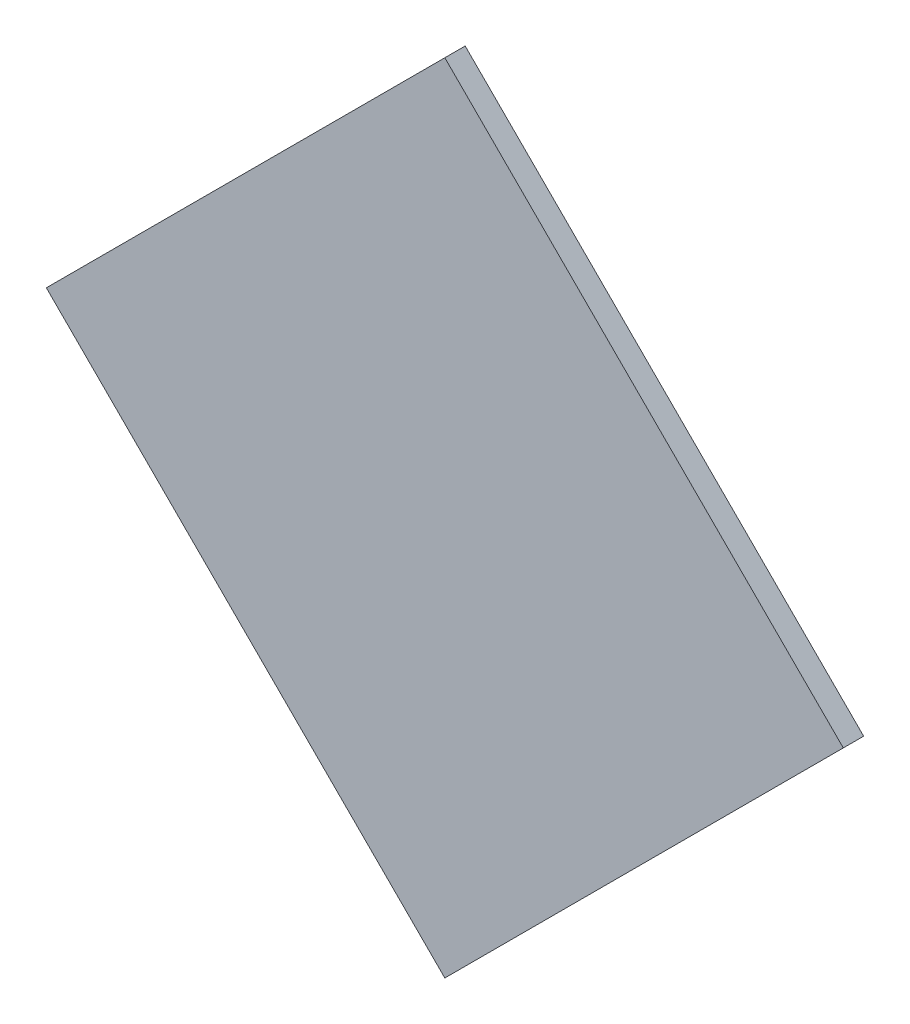
ISO-10303-21;
HEADER;
FILE_DESCRIPTION(('STEP AP214'),'2;1');
FILE_NAME('part.step','',(''),(''),'','','');
FILE_SCHEMA(('AUTOMOTIVE_DESIGN { 1 0 10303 214 1 1 1 1 }'));
ENDSEC;
DATA;
#1=APPLICATION_CONTEXT('core data for automotive mechanical design processes');
#2=APPLICATION_PROTOCOL_DEFINITION('international standard','automotive_design',2000,#1);
#3=PRODUCT_CONTEXT('',#1,'mechanical');
#4=PRODUCT('Part','Part','',(#3));
#5=PRODUCT_RELATED_PRODUCT_CATEGORY('part','',(#4));
#6=PRODUCT_DEFINITION_FORMATION('','',#4);
#7=PRODUCT_DEFINITION_CONTEXT('part definition',#1,'design');
#8=PRODUCT_DEFINITION('design','',#6,#7);
#9=PRODUCT_DEFINITION_SHAPE('','',#8);
#10=(LENGTH_UNIT() NAMED_UNIT(*) SI_UNIT(.MILLI.,.METRE.));
#11=(NAMED_UNIT(*) PLANE_ANGLE_UNIT() SI_UNIT($,.RADIAN.));
#12=(NAMED_UNIT(*) SI_UNIT($,.STERADIAN.) SOLID_ANGLE_UNIT());
#13=UNCERTAINTY_MEASURE_WITH_UNIT(LENGTH_MEASURE(1.E-05),#10,'distance_accuracy_value','');
#14=(GEOMETRIC_REPRESENTATION_CONTEXT(3) GLOBAL_UNCERTAINTY_ASSIGNED_CONTEXT((#13)) GLOBAL_UNIT_ASSIGNED_CONTEXT((#10,
#11,#12)) REPRESENTATION_CONTEXT('',''));
#15=CARTESIAN_POINT('',(0.,0.,0.));
#16=DIRECTION('',(0.,0.,1.));
#17=DIRECTION('',(1.,0.,0.));
#18=AXIS2_PLACEMENT_3D('',#15,#16,#17);
#19=CARTESIAN_POINT('',(6.253942,4.089398,0.76487));
#20=DIRECTION('',(0.,0.,-1.));
#21=DIRECTION('',(0.,1.,0.));
#22=AXIS2_PLACEMENT_3D('',#19,#20,#21);
#23=PLANE('',#22);
#24=DIRECTION('',(0.707106781186548,0.707106781186548,0.));
#25=VECTOR('',#24,1.);
#26=CARTESIAN_POINT('',(5.582190667,4.089398,0.76487));
#27=LINE('',#26,#25);
#28=CARTESIAN_POINT('',(5.582190667,4.089398,0.76487));
#29=VERTEX_POINT('',#28);
#30=CARTESIAN_POINT('',(6.253942,4.761149333,0.76487));
#31=VERTEX_POINT('',#30);
#32=EDGE_CURVE('E55',#29,#31,#27,.T.);
#33=ORIENTED_EDGE('',*,*,#32,.T.);
#34=DIRECTION('',(0.707106781186548,-0.707106781186548,0.));
#35=VECTOR('',#34,1.);
#36=CARTESIAN_POINT('',(6.253942,4.761149333,0.76487));
#37=LINE('',#36,#35);
#38=CARTESIAN_POINT('',(6.925693333,4.089398,0.76487));
#39=VERTEX_POINT('',#38);
#40=EDGE_CURVE('E57',#31,#39,#37,.T.);
#41=ORIENTED_EDGE('',*,*,#40,.T.);
#42=DIRECTION('',(-0.707106781186548,-0.707106781186548,0.));
#43=VECTOR('',#42,1.);
#44=CARTESIAN_POINT('',(6.925693333,4.089398,0.76487));
#45=LINE('',#44,#43);
#46=CARTESIAN_POINT('',(6.253942,3.417646667,0.76487));
#47=VERTEX_POINT('',#46);
#48=EDGE_CURVE('E20',#39,#47,#45,.T.);
#49=ORIENTED_EDGE('',*,*,#48,.T.);
#50=DIRECTION('',(-0.707106781186548,0.707106781186548,0.));
#51=VECTOR('',#50,1.);
#52=CARTESIAN_POINT('',(6.253942,3.417646667,0.76487));
#53=LINE('',#52,#51);
#54=EDGE_CURVE('E80',#47,#29,#53,.T.);
#55=ORIENTED_EDGE('',*,*,#54,.T.);
#56=EDGE_LOOP('',(#33,#41,#49,#55));
#57=FACE_BOUND('',#56,.T.);
#58=ADVANCED_FACE('F17',(#57),#23,.T.);
#59=CARTESIAN_POINT('',(6.925693333,4.089398,0.76487));
#60=DIRECTION('',(-0.707106781186548,0.707106781186548,0.));
#61=DIRECTION('',(-0.707106781186548,-0.707106781186548,0.));
#62=AXIS2_PLACEMENT_3D('',#59,#60,#61);
#63=PLANE('',#62);
#64=DIRECTION('',(0.,0.,1.));
#65=VECTOR('',#64,1.);
#66=CARTESIAN_POINT('',(6.253942,3.417646667,0.76487));
#67=LINE('',#66,#65);
#68=CARTESIAN_POINT('',(6.253942,3.417646667,0.79916));
#69=VERTEX_POINT('',#68);
#70=EDGE_CURVE('E68',#69,#47,#67,.F.);
#71=ORIENTED_EDGE('',*,*,#70,.T.);
#72=ORIENTED_EDGE('',*,*,#48,.F.);
#73=DIRECTION('',(0.,0.,1.));
#74=VECTOR('',#73,1.);
#75=CARTESIAN_POINT('',(6.925693333,4.089398,0.76487));
#76=LINE('',#75,#74);
#77=CARTESIAN_POINT('',(6.925693333,4.089398,0.79916));
#78=VERTEX_POINT('',#77);
#79=EDGE_CURVE('E63',#39,#78,#76,.T.);
#80=ORIENTED_EDGE('',*,*,#79,.T.);
#81=DIRECTION('',(0.707106781186548,0.707106781186548,0.));
#82=VECTOR('',#81,1.);
#83=CARTESIAN_POINT('',(6.253942,3.417646667,0.79916));
#84=LINE('',#83,#82);
#85=EDGE_CURVE('E83',#69,#78,#84,.T.);
#86=ORIENTED_EDGE('',*,*,#85,.F.);
#87=EDGE_LOOP('',(#71,#72,#80,#86));
#88=FACE_BOUND('',#87,.T.);
#89=ADVANCED_FACE('F65',(#88),#63,.F.);
#90=CARTESIAN_POINT('',(6.253942,4.761149333,0.76487));
#91=DIRECTION('',(-0.707106781186548,-0.707106781186548,0.));
#92=DIRECTION('',(0.707106781186548,-0.707106781186548,0.));
#93=AXIS2_PLACEMENT_3D('',#90,#91,#92);
#94=PLANE('',#93);
#95=ORIENTED_EDGE('',*,*,#79,.F.);
#96=ORIENTED_EDGE('',*,*,#40,.F.);
#97=DIRECTION('',(0.,0.,1.));
#98=VECTOR('',#97,1.);
#99=CARTESIAN_POINT('',(6.253942,4.761149333,0.76487));
#100=LINE('',#99,#98);
#101=CARTESIAN_POINT('',(6.253942,4.761149333,0.79916));
#102=VERTEX_POINT('',#101);
#103=EDGE_CURVE('E75',#31,#102,#100,.T.);
#104=ORIENTED_EDGE('',*,*,#103,.T.);
#105=DIRECTION('',(-0.707106781186548,0.707106781186548,0.));
#106=VECTOR('',#105,1.);
#107=CARTESIAN_POINT('',(6.925693333,4.089398,0.79916));
#108=LINE('',#107,#106);
#109=EDGE_CURVE('E72',#78,#102,#108,.T.);
#110=ORIENTED_EDGE('',*,*,#109,.F.);
#111=EDGE_LOOP('',(#95,#96,#104,#110));
#112=FACE_BOUND('',#111,.T.);
#113=ADVANCED_FACE('F70',(#112),#94,.F.);
#114=CARTESIAN_POINT('',(5.582190667,4.089398,0.76487));
#115=DIRECTION('',(0.707106781186548,-0.707106781186548,0.));
#116=DIRECTION('',(0.707106781186548,0.707106781186548,0.));
#117=AXIS2_PLACEMENT_3D('',#114,#115,#116);
#118=PLANE('',#117);
#119=ORIENTED_EDGE('',*,*,#103,.F.);
#120=ORIENTED_EDGE('',*,*,#32,.F.);
#121=DIRECTION('',(0.,0.,1.));
#122=VECTOR('',#121,1.);
#123=CARTESIAN_POINT('',(5.582190667,4.089398,0.76487));
#124=LINE('',#123,#122);
#125=CARTESIAN_POINT('',(5.582190667,4.089398,0.79916));
#126=VERTEX_POINT('',#125);
#127=EDGE_CURVE('E35',#29,#126,#124,.T.);
#128=ORIENTED_EDGE('',*,*,#127,.T.);
#129=DIRECTION('',(-0.707106781186548,-0.707106781186548,0.));
#130=VECTOR('',#129,1.);
#131=CARTESIAN_POINT('',(6.253942,4.761149333,0.79916));
#132=LINE('',#131,#130);
#133=EDGE_CURVE('E26',#102,#126,#132,.T.);
#134=ORIENTED_EDGE('',*,*,#133,.F.);
#135=EDGE_LOOP('',(#119,#120,#128,#134));
#136=FACE_BOUND('',#135,.T.);
#137=ADVANCED_FACE('F89',(#136),#118,.F.);
#138=CARTESIAN_POINT('',(6.253942,3.417646667,0.76487));
#139=DIRECTION('',(0.707106781186548,0.707106781186548,0.));
#140=DIRECTION('',(-0.707106781186548,0.707106781186548,0.));
#141=AXIS2_PLACEMENT_3D('',#138,#139,#140);
#142=PLANE('',#141);
#143=ORIENTED_EDGE('',*,*,#127,.F.);
#144=ORIENTED_EDGE('',*,*,#54,.F.);
#145=ORIENTED_EDGE('',*,*,#70,.F.);
#146=DIRECTION('',(0.707106781186548,-0.707106781186548,0.));
#147=VECTOR('',#146,1.);
#148=CARTESIAN_POINT('',(5.582190667,4.089398,0.79916));
#149=LINE('',#148,#147);
#150=EDGE_CURVE('E11',#126,#69,#149,.T.);
#151=ORIENTED_EDGE('',*,*,#150,.F.);
#152=EDGE_LOOP('',(#143,#144,#145,#151));
#153=FACE_BOUND('',#152,.T.);
#154=ADVANCED_FACE('F91',(#153),#142,.F.);
#155=CARTESIAN_POINT('',(6.253942,4.089398,0.79916));
#156=DIRECTION('',(0.,0.,1.));
#157=DIRECTION('',(0.,-1.,0.));
#158=AXIS2_PLACEMENT_3D('',#155,#156,#157);
#159=PLANE('',#158);
#160=ORIENTED_EDGE('',*,*,#133,.T.);
#161=ORIENTED_EDGE('',*,*,#150,.T.);
#162=ORIENTED_EDGE('',*,*,#85,.T.);
#163=ORIENTED_EDGE('',*,*,#109,.T.);
#164=EDGE_LOOP('',(#160,#161,#162,#163));
#165=FACE_BOUND('',#164,.T.);
#166=ADVANCED_FACE('F88',(#165),#159,.T.);
#167=CLOSED_SHELL('',(#58,#89,#113,#137,#154,#166));
#168=MANIFOLD_SOLID_BREP('B1',#167);
#169=ADVANCED_BREP_SHAPE_REPRESENTATION('',(#18,#168),#14);
#170=SHAPE_DEFINITION_REPRESENTATION(#9,#169);
ENDSEC;
END-ISO-10303-21;
